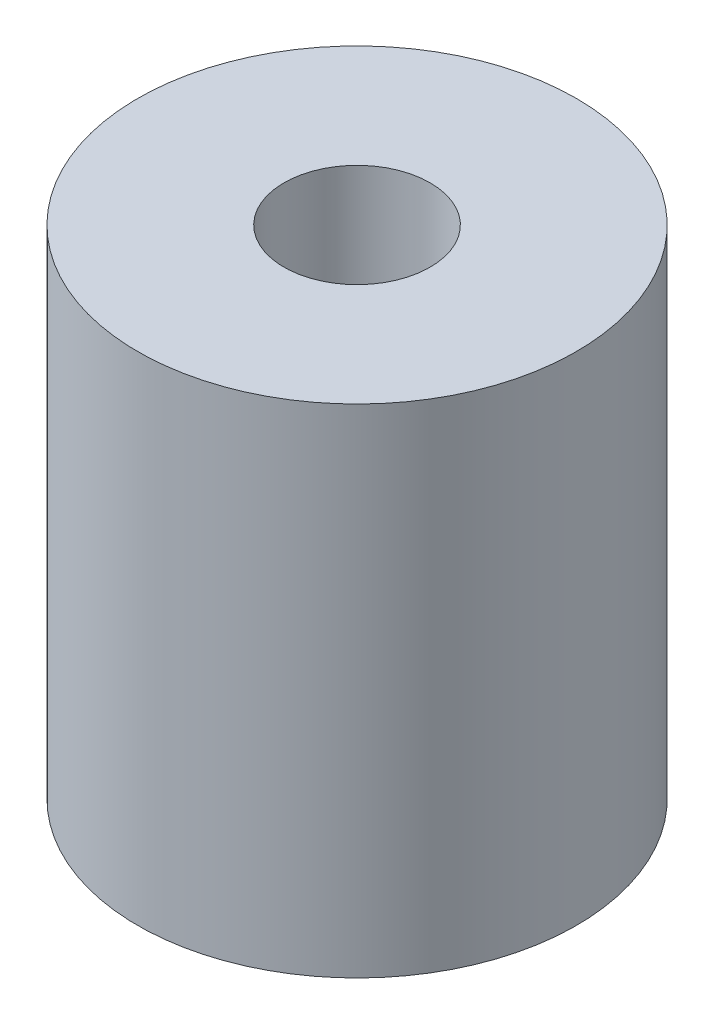
ISO-10303-21;
HEADER;
FILE_DESCRIPTION(('STEP AP214'),'2;1');
FILE_NAME('part.step','',(''),(''),'','','');
FILE_SCHEMA(('AUTOMOTIVE_DESIGN { 1 0 10303 214 1 1 1 1 }'));
ENDSEC;
DATA;
#1=APPLICATION_CONTEXT('core data for automotive mechanical design processes');
#2=APPLICATION_PROTOCOL_DEFINITION('international standard','automotive_design',2000,#1);
#3=PRODUCT_CONTEXT('',#1,'mechanical');
#4=PRODUCT('Part','Part','',(#3));
#5=PRODUCT_RELATED_PRODUCT_CATEGORY('part','',(#4));
#6=PRODUCT_DEFINITION_FORMATION('','',#4);
#7=PRODUCT_DEFINITION_CONTEXT('part definition',#1,'design');
#8=PRODUCT_DEFINITION('design','',#6,#7);
#9=PRODUCT_DEFINITION_SHAPE('','',#8);
#10=(LENGTH_UNIT() NAMED_UNIT(*) SI_UNIT(.MILLI.,.METRE.));
#11=(NAMED_UNIT(*) PLANE_ANGLE_UNIT() SI_UNIT($,.RADIAN.));
#12=(NAMED_UNIT(*) SI_UNIT($,.STERADIAN.) SOLID_ANGLE_UNIT());
#13=UNCERTAINTY_MEASURE_WITH_UNIT(LENGTH_MEASURE(1.E-05),#10,'distance_accuracy_value','');
#14=(GEOMETRIC_REPRESENTATION_CONTEXT(3) GLOBAL_UNCERTAINTY_ASSIGNED_CONTEXT((#13)) GLOBAL_UNIT_ASSIGNED_CONTEXT((#10,
#11,#12)) REPRESENTATION_CONTEXT('',''));
#15=CARTESIAN_POINT('',(0.,0.,0.));
#16=DIRECTION('',(0.,0.,1.));
#17=DIRECTION('',(1.,0.,0.));
#18=AXIS2_PLACEMENT_3D('',#15,#16,#17);
#19=CARTESIAN_POINT('',(0.,21.59,0.));
#20=DIRECTION('',(0.,-1.,0.));
#21=DIRECTION('',(0.,0.,-1.));
#22=AXIS2_PLACEMENT_3D('',#19,#20,#21);
#23=CYLINDRICAL_SURFACE('',#22,9.525);
#24=CARTESIAN_POINT('',(0.,21.59,0.));
#25=DIRECTION('',(0.,-1.,0.));
#26=DIRECTION('',(0.,0.,-1.));
#27=AXIS2_PLACEMENT_3D('',#24,#25,#26);
#28=CIRCLE('',#27,9.525);
#29=CARTESIAN_POINT('',(0.,21.59,-9.525));
#30=VERTEX_POINT('',#29);
#31=EDGE_CURVE('E10',#30,#30,#28,.T.);
#32=ORIENTED_EDGE('',*,*,#31,.T.);
#33=EDGE_LOOP('',(#32));
#34=FACE_BOUND('',#33,.T.);
#35=CARTESIAN_POINT('',(0.,0.,0.));
#36=DIRECTION('',(0.,-1.,0.));
#37=DIRECTION('',(0.,0.,-1.));
#38=AXIS2_PLACEMENT_3D('',#35,#36,#37);
#39=CIRCLE('',#38,9.525);
#40=CARTESIAN_POINT('',(0.,0.,-9.525));
#41=VERTEX_POINT('',#40);
#42=EDGE_CURVE('E58',#41,#41,#39,.T.);
#43=ORIENTED_EDGE('',*,*,#42,.F.);
#44=EDGE_LOOP('',(#43));
#45=FACE_BOUND('',#44,.T.);
#46=ADVANCED_FACE('F41',(#34,#45),#23,.T.);
#47=CARTESIAN_POINT('',(9.525,21.59,0.));
#48=DIRECTION('',(0.,1.,0.));
#49=DIRECTION('',(0.,0.,1.));
#50=AXIS2_PLACEMENT_3D('',#47,#48,#49);
#51=PLANE('',#50);
#52=CARTESIAN_POINT('',(0.,21.59,0.));
#53=DIRECTION('',(0.,-1.,0.));
#54=DIRECTION('',(0.,0.,-1.));
#55=AXIS2_PLACEMENT_3D('',#52,#53,#54);
#56=CIRCLE('',#55,3.175);
#57=CARTESIAN_POINT('',(0.,21.59,-3.175));
#58=VERTEX_POINT('',#57);
#59=EDGE_CURVE('E48',#58,#58,#56,.T.);
#60=ORIENTED_EDGE('',*,*,#59,.T.);
#61=EDGE_LOOP('',(#60));
#62=FACE_BOUND('',#61,.T.);
#63=ORIENTED_EDGE('',*,*,#31,.F.);
#64=EDGE_LOOP('',(#63));
#65=FACE_BOUND('',#64,.T.);
#66=ADVANCED_FACE('F69',(#62,#65),#51,.T.);
#67=CARTESIAN_POINT('',(0.,21.59,0.));
#68=DIRECTION('',(0.,-1.,0.));
#69=DIRECTION('',(0.,0.,-1.));
#70=AXIS2_PLACEMENT_3D('',#67,#68,#69);
#71=CYLINDRICAL_SURFACE('',#70,3.175);
#72=CARTESIAN_POINT('',(0.,0.,0.));
#73=DIRECTION('',(0.,-1.,0.));
#74=DIRECTION('',(0.,0.,-1.));
#75=AXIS2_PLACEMENT_3D('',#72,#73,#74);
#76=CIRCLE('',#75,3.175);
#77=CARTESIAN_POINT('',(0.,0.,-3.175));
#78=VERTEX_POINT('',#77);
#79=EDGE_CURVE('E53',#78,#78,#76,.T.);
#80=ORIENTED_EDGE('',*,*,#79,.T.);
#81=EDGE_LOOP('',(#80));
#82=FACE_BOUND('',#81,.T.);
#83=ORIENTED_EDGE('',*,*,#59,.F.);
#84=EDGE_LOOP('',(#83));
#85=FACE_BOUND('',#84,.T.);
#86=ADVANCED_FACE('F73',(#82,#85),#71,.F.);
#87=CARTESIAN_POINT('',(3.175,0.,0.));
#88=DIRECTION('',(0.,-1.,0.));
#89=DIRECTION('',(0.,0.,-1.));
#90=AXIS2_PLACEMENT_3D('',#87,#88,#89);
#91=PLANE('',#90);
#92=ORIENTED_EDGE('',*,*,#42,.T.);
#93=EDGE_LOOP('',(#92));
#94=FACE_BOUND('',#93,.T.);
#95=ORIENTED_EDGE('',*,*,#79,.F.);
#96=EDGE_LOOP('',(#95));
#97=FACE_BOUND('',#96,.T.);
#98=ADVANCED_FACE('F65',(#94,#97),#91,.T.);
#99=CLOSED_SHELL('',(#46,#66,#86,#98));
#100=MANIFOLD_SOLID_BREP('B2',#99);
#101=ADVANCED_BREP_SHAPE_REPRESENTATION('',(#18,#100),#14);
#102=SHAPE_DEFINITION_REPRESENTATION(#9,#101);
ENDSEC;
END-ISO-10303-21;
